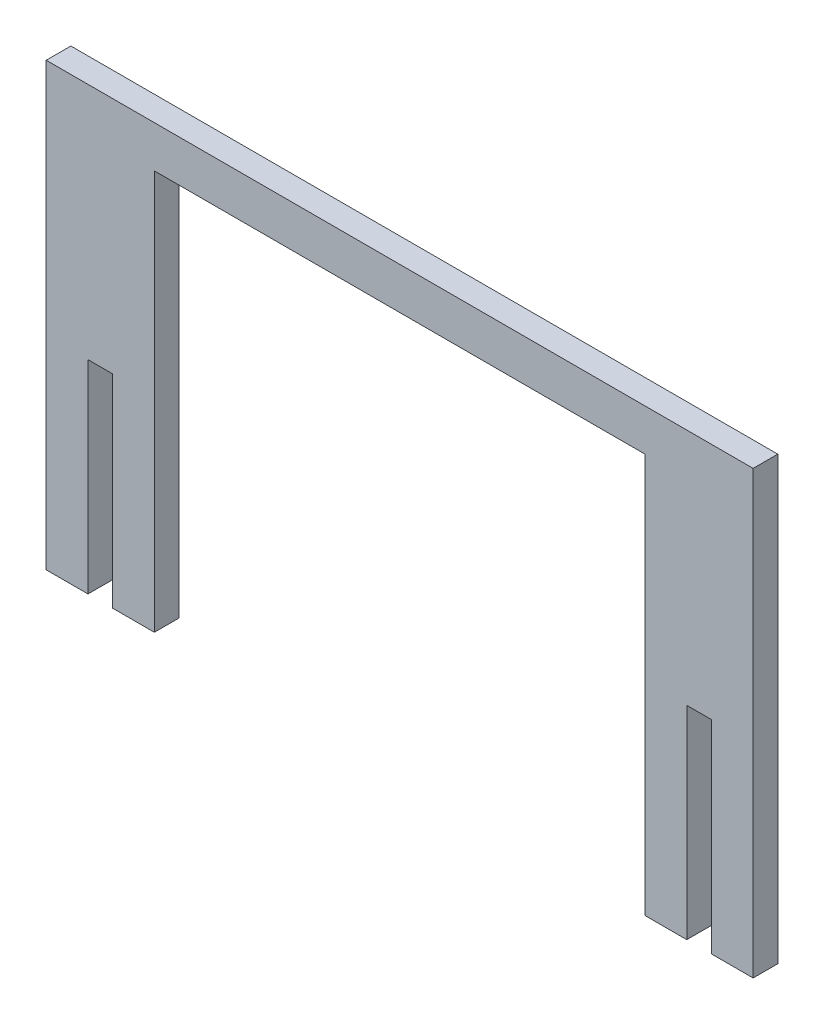
ISO-10303-21;
HEADER;
FILE_DESCRIPTION(('STEP AP214'),'2;1');
FILE_NAME('part.step','',(''),(''),'','','');
FILE_SCHEMA(('AUTOMOTIVE_DESIGN { 1 0 10303 214 1 1 1 1 }'));
ENDSEC;
DATA;
#1=APPLICATION_CONTEXT('core data for automotive mechanical design processes');
#2=APPLICATION_PROTOCOL_DEFINITION('international standard','automotive_design',2000,#1);
#3=PRODUCT_CONTEXT('',#1,'mechanical');
#4=PRODUCT('Part','Part','',(#3));
#5=PRODUCT_RELATED_PRODUCT_CATEGORY('part','',(#4));
#6=PRODUCT_DEFINITION_FORMATION('','',#4);
#7=PRODUCT_DEFINITION_CONTEXT('part definition',#1,'design');
#8=PRODUCT_DEFINITION('design','',#6,#7);
#9=PRODUCT_DEFINITION_SHAPE('','',#8);
#10=(LENGTH_UNIT() NAMED_UNIT(*) SI_UNIT(.MILLI.,.METRE.));
#11=(NAMED_UNIT(*) PLANE_ANGLE_UNIT() SI_UNIT($,.RADIAN.));
#12=(NAMED_UNIT(*) SI_UNIT($,.STERADIAN.) SOLID_ANGLE_UNIT());
#13=UNCERTAINTY_MEASURE_WITH_UNIT(LENGTH_MEASURE(1.E-05),#10,'distance_accuracy_value','');
#14=(GEOMETRIC_REPRESENTATION_CONTEXT(3) GLOBAL_UNCERTAINTY_ASSIGNED_CONTEXT((#13)) GLOBAL_UNIT_ASSIGNED_CONTEXT((#10,
#11,#12)) REPRESENTATION_CONTEXT('',''));
#15=CARTESIAN_POINT('',(0.,0.,0.));
#16=DIRECTION('',(0.,0.,1.));
#17=DIRECTION('',(1.,0.,0.));
#18=AXIS2_PLACEMENT_3D('',#15,#16,#17);
#19=CARTESIAN_POINT('',(0.,-0.762000000000471,2.9972));
#20=DIRECTION('',(-1.,0.,0.));
#21=DIRECTION('',(0.,0.,1.));
#22=AXIS2_PLACEMENT_3D('',#19,#20,#21);
#23=PLANE('',#22);
#24=DIRECTION('',(0.,1.,0.));
#25=VECTOR('',#24,1.);
#26=CARTESIAN_POINT('',(0.,-0.762000000000471,0.));
#27=LINE('',#26,#25);
#28=CARTESIAN_POINT('',(0.,-0.762000000000471,0.));
#29=VERTEX_POINT('',#28);
#30=CARTESIAN_POINT('',(0.,23.9268,0.));
#31=VERTEX_POINT('',#30);
#32=EDGE_CURVE('E177',#29,#31,#27,.T.);
#33=ORIENTED_EDGE('',*,*,#32,.T.);
#34=DIRECTION('',(0.,0.,-1.));
#35=VECTOR('',#34,1.);
#36=CARTESIAN_POINT('',(0.,23.9268,2.9972));
#37=LINE('',#36,#35);
#38=CARTESIAN_POINT('',(0.,23.9268,2.9972));
#39=VERTEX_POINT('',#38);
#40=EDGE_CURVE('E11',#39,#31,#37,.T.);
#41=ORIENTED_EDGE('',*,*,#40,.F.);
#42=DIRECTION('',(0.,1.,0.));
#43=VECTOR('',#42,1.);
#44=CARTESIAN_POINT('',(0.,-0.762000000000471,2.9972));
#45=LINE('',#44,#43);
#46=CARTESIAN_POINT('',(0.,-0.762000000000471,2.9972));
#47=VERTEX_POINT('',#46);
#48=EDGE_CURVE('E207',#47,#39,#45,.T.);
#49=ORIENTED_EDGE('',*,*,#48,.F.);
#50=DIRECTION('',(0.,0.,-1.));
#51=VECTOR('',#50,1.);
#52=CARTESIAN_POINT('',(0.,-0.762000000000471,2.9972));
#53=LINE('',#52,#51);
#54=EDGE_CURVE('E173',#47,#29,#53,.T.);
#55=ORIENTED_EDGE('',*,*,#54,.T.);
#56=EDGE_LOOP('',(#33,#41,#49,#55));
#57=FACE_BOUND('',#56,.T.);
#58=ADVANCED_FACE('F33',(#57),#23,.F.);
#59=CARTESIAN_POINT('',(0.,23.9268,2.9972));
#60=DIRECTION('',(0.,1.,0.));
#61=DIRECTION('',(0.,0.,1.));
#62=AXIS2_PLACEMENT_3D('',#59,#60,#61);
#63=PLANE('',#62);
#64=DIRECTION('',(1.,0.,0.));
#65=VECTOR('',#64,1.);
#66=CARTESIAN_POINT('',(0.,23.9268,0.));
#67=LINE('',#66,#65);
#68=CARTESIAN_POINT('',(2.9972,23.9268,0.));
#69=VERTEX_POINT('',#68);
#70=EDGE_CURVE('E180',#31,#69,#67,.T.);
#71=ORIENTED_EDGE('',*,*,#70,.T.);
#72=DIRECTION('',(0.,0.,-1.));
#73=VECTOR('',#72,1.);
#74=CARTESIAN_POINT('',(2.9972,23.9268,2.9972));
#75=LINE('',#74,#73);
#76=CARTESIAN_POINT('',(2.9972,23.9268,2.9972));
#77=VERTEX_POINT('',#76);
#78=EDGE_CURVE('E41',#77,#69,#75,.T.);
#79=ORIENTED_EDGE('',*,*,#78,.F.);
#80=DIRECTION('',(1.,0.,0.));
#81=VECTOR('',#80,1.);
#82=CARTESIAN_POINT('',(0.,23.9268,2.9972));
#83=LINE('',#82,#81);
#84=EDGE_CURVE('E116',#39,#77,#83,.T.);
#85=ORIENTED_EDGE('',*,*,#84,.F.);
#86=ORIENTED_EDGE('',*,*,#40,.T.);
#87=EDGE_LOOP('',(#71,#79,#85,#86));
#88=FACE_BOUND('',#87,.T.);
#89=ADVANCED_FACE('F305',(#88),#63,.F.);
#90=CARTESIAN_POINT('',(2.9972,23.9268,2.9972));
#91=DIRECTION('',(1.,0.,0.));
#92=DIRECTION('',(0.,1.,0.));
#93=AXIS2_PLACEMENT_3D('',#90,#91,#92);
#94=PLANE('',#93);
#95=DIRECTION('',(0.,-1.,0.));
#96=VECTOR('',#95,1.);
#97=CARTESIAN_POINT('',(2.9972,23.9268,0.));
#98=LINE('',#97,#96);
#99=CARTESIAN_POINT('',(2.9972,-0.762000000000472,0.));
#100=VERTEX_POINT('',#99);
#101=EDGE_CURVE('E182',#69,#100,#98,.T.);
#102=ORIENTED_EDGE('',*,*,#101,.T.);
#103=DIRECTION('',(0.,0.,-1.));
#104=VECTOR('',#103,1.);
#105=CARTESIAN_POINT('',(2.9972,-0.762000000000472,2.9972));
#106=LINE('',#105,#104);
#107=CARTESIAN_POINT('',(2.9972,-0.762000000000472,2.9972));
#108=VERTEX_POINT('',#107);
#109=EDGE_CURVE('E238',#108,#100,#106,.T.);
#110=ORIENTED_EDGE('',*,*,#109,.F.);
#111=DIRECTION('',(0.,-1.,0.));
#112=VECTOR('',#111,1.);
#113=CARTESIAN_POINT('',(2.9972,23.9268,2.9972));
#114=LINE('',#113,#112);
#115=EDGE_CURVE('E246',#77,#108,#114,.T.);
#116=ORIENTED_EDGE('',*,*,#115,.F.);
#117=ORIENTED_EDGE('',*,*,#78,.T.);
#118=EDGE_LOOP('',(#102,#110,#116,#117));
#119=FACE_BOUND('',#118,.T.);
#120=ADVANCED_FACE('F244',(#119),#94,.F.);
#121=CARTESIAN_POINT('',(2.9972,-0.762000000000472,2.9972));
#122=DIRECTION('',(0.,1.,0.));
#123=DIRECTION('',(0.,0.,1.));
#124=AXIS2_PLACEMENT_3D('',#121,#122,#123);
#125=PLANE('',#124);
#126=DIRECTION('',(1.,0.,0.));
#127=VECTOR('',#126,1.);
#128=CARTESIAN_POINT('',(2.9972,-0.762000000000472,0.));
#129=LINE('',#128,#127);
#130=CARTESIAN_POINT('',(8.07720000000001,-0.762000000000472,0.));
#131=VERTEX_POINT('',#130);
#132=EDGE_CURVE('E184',#100,#131,#129,.T.);
#133=ORIENTED_EDGE('',*,*,#132,.T.);
#134=DIRECTION('',(0.,0.,-1.));
#135=VECTOR('',#134,1.);
#136=CARTESIAN_POINT('',(8.07720000000001,-0.762000000000472,2.9972));
#137=LINE('',#136,#135);
#138=CARTESIAN_POINT('',(8.07720000000001,-0.762000000000472,2.9972));
#139=VERTEX_POINT('',#138);
#140=EDGE_CURVE('E235',#139,#131,#137,.T.);
#141=ORIENTED_EDGE('',*,*,#140,.F.);
#142=DIRECTION('',(1.,0.,0.));
#143=VECTOR('',#142,1.);
#144=CARTESIAN_POINT('',(2.9972,-0.762000000000472,2.9972));
#145=LINE('',#144,#143);
#146=EDGE_CURVE('E264',#108,#139,#145,.T.);
#147=ORIENTED_EDGE('',*,*,#146,.F.);
#148=ORIENTED_EDGE('',*,*,#109,.T.);
#149=EDGE_LOOP('',(#133,#141,#147,#148));
#150=FACE_BOUND('',#149,.T.);
#151=ADVANCED_FACE('F255',(#150),#125,.F.);
#152=CARTESIAN_POINT('',(8.07720000000001,-0.762000000000472,2.9972));
#153=DIRECTION('',(-1.,0.,0.));
#154=DIRECTION('',(0.,0.,1.));
#155=AXIS2_PLACEMENT_3D('',#152,#153,#154);
#156=PLANE('',#155);
#157=DIRECTION('',(0.,1.,0.));
#158=VECTOR('',#157,1.);
#159=CARTESIAN_POINT('',(8.07720000000001,-0.762000000000472,0.));
#160=LINE('',#159,#158);
#161=CARTESIAN_POINT('',(8.07720000000001,47.8536,0.));
#162=VERTEX_POINT('',#161);
#163=EDGE_CURVE('E186',#131,#162,#160,.T.);
#164=ORIENTED_EDGE('',*,*,#163,.T.);
#165=DIRECTION('',(0.,0.,-1.));
#166=VECTOR('',#165,1.);
#167=CARTESIAN_POINT('',(8.07720000000001,47.8536,2.9972));
#168=LINE('',#167,#166);
#169=CARTESIAN_POINT('',(8.07720000000001,47.8536,2.9972));
#170=VERTEX_POINT('',#169);
#171=EDGE_CURVE('E232',#170,#162,#168,.T.);
#172=ORIENTED_EDGE('',*,*,#171,.F.);
#173=DIRECTION('',(0.,1.,0.));
#174=VECTOR('',#173,1.);
#175=CARTESIAN_POINT('',(8.07720000000001,-0.762000000000472,2.9972));
#176=LINE('',#175,#174);
#177=EDGE_CURVE('E261',#139,#170,#176,.T.);
#178=ORIENTED_EDGE('',*,*,#177,.F.);
#179=ORIENTED_EDGE('',*,*,#140,.T.);
#180=EDGE_LOOP('',(#164,#172,#178,#179));
#181=FACE_BOUND('',#180,.T.);
#182=ADVANCED_FACE('F259',(#181),#156,.F.);
#183=CARTESIAN_POINT('',(8.07720000000001,47.8536,2.9972));
#184=DIRECTION('',(0.,1.,0.));
#185=DIRECTION('',(0.,0.,1.));
#186=AXIS2_PLACEMENT_3D('',#183,#184,#185);
#187=PLANE('',#186);
#188=DIRECTION('',(1.,0.,0.));
#189=VECTOR('',#188,1.);
#190=CARTESIAN_POINT('',(8.07720000000001,47.8536,0.));
#191=LINE('',#190,#189);
#192=CARTESIAN_POINT('',(67.7672,47.8536,0.));
#193=VERTEX_POINT('',#192);
#194=EDGE_CURVE('E188',#162,#193,#191,.T.);
#195=ORIENTED_EDGE('',*,*,#194,.T.);
#196=DIRECTION('',(0.,0.,-1.));
#197=VECTOR('',#196,1.);
#198=CARTESIAN_POINT('',(67.7672,47.8536,2.9972));
#199=LINE('',#198,#197);
#200=CARTESIAN_POINT('',(67.7672,47.8536,2.9972));
#201=VERTEX_POINT('',#200);
#202=EDGE_CURVE('E229',#201,#193,#199,.T.);
#203=ORIENTED_EDGE('',*,*,#202,.F.);
#204=DIRECTION('',(1.,0.,0.));
#205=VECTOR('',#204,1.);
#206=CARTESIAN_POINT('',(8.07720000000001,47.8536,2.9972));
#207=LINE('',#206,#205);
#208=EDGE_CURVE('E263',#170,#201,#207,.T.);
#209=ORIENTED_EDGE('',*,*,#208,.F.);
#210=ORIENTED_EDGE('',*,*,#171,.T.);
#211=EDGE_LOOP('',(#195,#203,#209,#210));
#212=FACE_BOUND('',#211,.T.);
#213=ADVANCED_FACE('F318',(#212),#187,.F.);
#214=CARTESIAN_POINT('',(67.7672,47.8536,2.9972));
#215=DIRECTION('',(1.,0.,0.));
#216=DIRECTION('',(0.,0.,-1.));
#217=AXIS2_PLACEMENT_3D('',#214,#215,#216);
#218=PLANE('',#217);
#219=DIRECTION('',(0.,-1.,0.));
#220=VECTOR('',#219,1.);
#221=CARTESIAN_POINT('',(67.7672,47.8536,0.));
#222=LINE('',#221,#220);
#223=CARTESIAN_POINT('',(67.7672,-0.762000000000471,0.));
#224=VERTEX_POINT('',#223);
#225=EDGE_CURVE('E190',#193,#224,#222,.T.);
#226=ORIENTED_EDGE('',*,*,#225,.T.);
#227=DIRECTION('',(0.,0.,-1.));
#228=VECTOR('',#227,1.);
#229=CARTESIAN_POINT('',(67.7672,-0.762000000000471,2.9972));
#230=LINE('',#229,#228);
#231=CARTESIAN_POINT('',(67.7672,-0.762000000000471,2.9972));
#232=VERTEX_POINT('',#231);
#233=EDGE_CURVE('E226',#232,#224,#230,.T.);
#234=ORIENTED_EDGE('',*,*,#233,.F.);
#235=DIRECTION('',(0.,-1.,0.));
#236=VECTOR('',#235,1.);
#237=CARTESIAN_POINT('',(67.7672,47.8536,2.9972));
#238=LINE('',#237,#236);
#239=EDGE_CURVE('E266',#201,#232,#238,.T.);
#240=ORIENTED_EDGE('',*,*,#239,.F.);
#241=ORIENTED_EDGE('',*,*,#202,.T.);
#242=EDGE_LOOP('',(#226,#234,#240,#241));
#243=FACE_BOUND('',#242,.T.);
#244=ADVANCED_FACE('F321',(#243),#218,.F.);
#245=CARTESIAN_POINT('',(67.7672,-0.762000000000471,2.9972));
#246=DIRECTION('',(0.,1.,0.));
#247=DIRECTION('',(-1.,0.,0.));
#248=AXIS2_PLACEMENT_3D('',#245,#246,#247);
#249=PLANE('',#248);
#250=DIRECTION('',(1.,0.,0.));
#251=VECTOR('',#250,1.);
#252=CARTESIAN_POINT('',(67.7672,-0.762000000000471,0.));
#253=LINE('',#252,#251);
#254=CARTESIAN_POINT('',(72.8472,-0.762000000000474,0.));
#255=VERTEX_POINT('',#254);
#256=EDGE_CURVE('E192',#224,#255,#253,.T.);
#257=ORIENTED_EDGE('',*,*,#256,.T.);
#258=DIRECTION('',(0.,0.,-1.));
#259=VECTOR('',#258,1.);
#260=CARTESIAN_POINT('',(72.8472,-0.762000000000474,2.9972));
#261=LINE('',#260,#259);
#262=CARTESIAN_POINT('',(72.8472,-0.762000000000474,2.9972));
#263=VERTEX_POINT('',#262);
#264=EDGE_CURVE('E223',#263,#255,#261,.T.);
#265=ORIENTED_EDGE('',*,*,#264,.F.);
#266=DIRECTION('',(1.,0.,0.));
#267=VECTOR('',#266,1.);
#268=CARTESIAN_POINT('',(67.7672,-0.762000000000471,2.9972));
#269=LINE('',#268,#267);
#270=EDGE_CURVE('E272',#232,#263,#269,.T.);
#271=ORIENTED_EDGE('',*,*,#270,.F.);
#272=ORIENTED_EDGE('',*,*,#233,.T.);
#273=EDGE_LOOP('',(#257,#265,#271,#272));
#274=FACE_BOUND('',#273,.T.);
#275=ADVANCED_FACE('F325',(#274),#249,.F.);
#276=CARTESIAN_POINT('',(72.8472,23.9268,2.9972));
#277=DIRECTION('',(-1.,0.,0.));
#278=DIRECTION('',(0.,0.,1.));
#279=AXIS2_PLACEMENT_3D('',#276,#277,#278);
#280=PLANE('',#279);
#281=DIRECTION('',(0.,1.,0.));
#282=VECTOR('',#281,1.);
#283=CARTESIAN_POINT('',(72.8472,23.9268,0.));
#284=LINE('',#283,#282);
#285=CARTESIAN_POINT('',(72.8472,23.9268,0.));
#286=VERTEX_POINT('',#285);
#287=EDGE_CURVE('E194',#255,#286,#284,.T.);
#288=ORIENTED_EDGE('',*,*,#287,.T.);
#289=DIRECTION('',(0.,0.,-1.));
#290=VECTOR('',#289,1.);
#291=CARTESIAN_POINT('',(72.8472,23.9268,2.9972));
#292=LINE('',#291,#290);
#293=CARTESIAN_POINT('',(72.8472,23.9268,2.9972));
#294=VERTEX_POINT('',#293);
#295=EDGE_CURVE('E220',#294,#286,#292,.T.);
#296=ORIENTED_EDGE('',*,*,#295,.F.);
#297=DIRECTION('',(0.,1.,0.));
#298=VECTOR('',#297,1.);
#299=CARTESIAN_POINT('',(72.8472,23.9268,2.9972));
#300=LINE('',#299,#298);
#301=EDGE_CURVE('E274',#263,#294,#300,.T.);
#302=ORIENTED_EDGE('',*,*,#301,.F.);
#303=ORIENTED_EDGE('',*,*,#264,.T.);
#304=EDGE_LOOP('',(#288,#296,#302,#303));
#305=FACE_BOUND('',#304,.T.);
#306=ADVANCED_FACE('F329',(#305),#280,.F.);
#307=CARTESIAN_POINT('',(75.8444,23.9268,2.9972));
#308=DIRECTION('',(0.,1.,0.));
#309=DIRECTION('',(0.,0.,1.));
#310=AXIS2_PLACEMENT_3D('',#307,#308,#309);
#311=PLANE('',#310);
#312=DIRECTION('',(1.,0.,0.));
#313=VECTOR('',#312,1.);
#314=CARTESIAN_POINT('',(75.8444,23.9268,0.));
#315=LINE('',#314,#313);
#316=CARTESIAN_POINT('',(75.8444,23.9268,0.));
#317=VERTEX_POINT('',#316);
#318=EDGE_CURVE('E196',#286,#317,#315,.T.);
#319=ORIENTED_EDGE('',*,*,#318,.T.);
#320=DIRECTION('',(0.,0.,-1.));
#321=VECTOR('',#320,1.);
#322=CARTESIAN_POINT('',(75.8444,23.9268,2.9972));
#323=LINE('',#322,#321);
#324=CARTESIAN_POINT('',(75.8444,23.9268,2.9972));
#325=VERTEX_POINT('',#324);
#326=EDGE_CURVE('E217',#325,#317,#323,.T.);
#327=ORIENTED_EDGE('',*,*,#326,.F.);
#328=DIRECTION('',(1.,0.,0.));
#329=VECTOR('',#328,1.);
#330=CARTESIAN_POINT('',(75.8444,23.9268,2.9972));
#331=LINE('',#330,#329);
#332=EDGE_CURVE('E276',#294,#325,#331,.T.);
#333=ORIENTED_EDGE('',*,*,#332,.F.);
#334=ORIENTED_EDGE('',*,*,#295,.T.);
#335=EDGE_LOOP('',(#319,#327,#333,#334));
#336=FACE_BOUND('',#335,.T.);
#337=ADVANCED_FACE('F333',(#336),#311,.F.);
#338=CARTESIAN_POINT('',(75.8444,-0.762000000000473,2.9972));
#339=DIRECTION('',(1.,0.,0.));
#340=DIRECTION('',(0.,0.,-1.));
#341=AXIS2_PLACEMENT_3D('',#338,#339,#340);
#342=PLANE('',#341);
#343=DIRECTION('',(0.,-1.,0.));
#344=VECTOR('',#343,1.);
#345=CARTESIAN_POINT('',(75.8444,-0.762000000000473,0.));
#346=LINE('',#345,#344);
#347=CARTESIAN_POINT('',(75.8444,-0.762000000000473,0.));
#348=VERTEX_POINT('',#347);
#349=EDGE_CURVE('E198',#317,#348,#346,.T.);
#350=ORIENTED_EDGE('',*,*,#349,.T.);
#351=DIRECTION('',(0.,0.,-1.));
#352=VECTOR('',#351,1.);
#353=CARTESIAN_POINT('',(75.8444,-0.762000000000473,2.9972));
#354=LINE('',#353,#352);
#355=CARTESIAN_POINT('',(75.8444,-0.762000000000473,2.9972));
#356=VERTEX_POINT('',#355);
#357=EDGE_CURVE('E214',#356,#348,#354,.T.);
#358=ORIENTED_EDGE('',*,*,#357,.F.);
#359=DIRECTION('',(0.,-1.,0.));
#360=VECTOR('',#359,1.);
#361=CARTESIAN_POINT('',(75.8444,-0.762000000000473,2.9972));
#362=LINE('',#361,#360);
#363=EDGE_CURVE('E278',#325,#356,#362,.T.);
#364=ORIENTED_EDGE('',*,*,#363,.F.);
#365=ORIENTED_EDGE('',*,*,#326,.T.);
#366=EDGE_LOOP('',(#350,#358,#364,#365));
#367=FACE_BOUND('',#366,.T.);
#368=ADVANCED_FACE('F337',(#367),#342,.F.);
#369=CARTESIAN_POINT('',(80.9244,-0.762000000000472,2.9972));
#370=DIRECTION('',(0.,1.,0.));
#371=DIRECTION('',(-1.,0.,0.));
#372=AXIS2_PLACEMENT_3D('',#369,#370,#371);
#373=PLANE('',#372);
#374=DIRECTION('',(1.,0.,0.));
#375=VECTOR('',#374,1.);
#376=CARTESIAN_POINT('',(80.9244,-0.762000000000472,0.));
#377=LINE('',#376,#375);
#378=CARTESIAN_POINT('',(80.9244,-0.762000000000472,0.));
#379=VERTEX_POINT('',#378);
#380=EDGE_CURVE('E200',#348,#379,#377,.T.);
#381=ORIENTED_EDGE('',*,*,#380,.T.);
#382=DIRECTION('',(0.,0.,-1.));
#383=VECTOR('',#382,1.);
#384=CARTESIAN_POINT('',(80.9244,-0.762000000000472,2.9972));
#385=LINE('',#384,#383);
#386=CARTESIAN_POINT('',(80.9244,-0.762000000000472,2.9972));
#387=VERTEX_POINT('',#386);
#388=EDGE_CURVE('E211',#387,#379,#385,.T.);
#389=ORIENTED_EDGE('',*,*,#388,.F.);
#390=DIRECTION('',(1.,0.,0.));
#391=VECTOR('',#390,1.);
#392=CARTESIAN_POINT('',(80.9244,-0.762000000000472,2.9972));
#393=LINE('',#392,#391);
#394=EDGE_CURVE('E280',#356,#387,#393,.T.);
#395=ORIENTED_EDGE('',*,*,#394,.F.);
#396=ORIENTED_EDGE('',*,*,#357,.T.);
#397=EDGE_LOOP('',(#381,#389,#395,#396));
#398=FACE_BOUND('',#397,.T.);
#399=ADVANCED_FACE('F286',(#398),#373,.F.);
#400=CARTESIAN_POINT('',(80.9244,52.9336,2.9972));
#401=DIRECTION('',(-1.,0.,0.));
#402=DIRECTION('',(0.,0.,1.));
#403=AXIS2_PLACEMENT_3D('',#400,#401,#402);
#404=PLANE('',#403);
#405=DIRECTION('',(0.,1.,0.));
#406=VECTOR('',#405,1.);
#407=CARTESIAN_POINT('',(80.9244,52.9336,0.));
#408=LINE('',#407,#406);
#409=CARTESIAN_POINT('',(80.9244,52.9336,0.));
#410=VERTEX_POINT('',#409);
#411=EDGE_CURVE('E202',#379,#410,#408,.T.);
#412=ORIENTED_EDGE('',*,*,#411,.T.);
#413=DIRECTION('',(0.,0.,-1.));
#414=VECTOR('',#413,1.);
#415=CARTESIAN_POINT('',(80.9244,52.9336,2.9972));
#416=LINE('',#415,#414);
#417=CARTESIAN_POINT('',(80.9244,52.9336,2.9972));
#418=VERTEX_POINT('',#417);
#419=EDGE_CURVE('E168',#418,#410,#416,.T.);
#420=ORIENTED_EDGE('',*,*,#419,.F.);
#421=DIRECTION('',(0.,1.,0.));
#422=VECTOR('',#421,1.);
#423=CARTESIAN_POINT('',(80.9244,52.9336,2.9972));
#424=LINE('',#423,#422);
#425=EDGE_CURVE('E159',#387,#418,#424,.T.);
#426=ORIENTED_EDGE('',*,*,#425,.F.);
#427=ORIENTED_EDGE('',*,*,#388,.T.);
#428=EDGE_LOOP('',(#412,#420,#426,#427));
#429=FACE_BOUND('',#428,.T.);
#430=ADVANCED_FACE('F290',(#429),#404,.F.);
#431=CARTESIAN_POINT('',(80.9244,52.9336,2.9972));
#432=DIRECTION('',(0.,-1.,0.));
#433=DIRECTION('',(1.,0.,0.));
#434=AXIS2_PLACEMENT_3D('',#431,#432,#433);
#435=PLANE('',#434);
#436=DIRECTION('',(-1.,0.,0.));
#437=VECTOR('',#436,1.);
#438=CARTESIAN_POINT('',(80.9244,52.9336,0.));
#439=LINE('',#438,#437);
#440=CARTESIAN_POINT('',(-5.08000000000001,52.9336,0.));
#441=VERTEX_POINT('',#440);
#442=EDGE_CURVE('E167',#410,#441,#439,.T.);
#443=ORIENTED_EDGE('',*,*,#442,.T.);
#444=DIRECTION('',(0.,0.,-1.));
#445=VECTOR('',#444,1.);
#446=CARTESIAN_POINT('',(-5.08000000000001,52.9336,2.9972));
#447=LINE('',#446,#445);
#448=CARTESIAN_POINT('',(-5.08000000000001,52.9336,2.9972));
#449=VERTEX_POINT('',#448);
#450=EDGE_CURVE('E164',#449,#441,#447,.T.);
#451=ORIENTED_EDGE('',*,*,#450,.F.);
#452=DIRECTION('',(-1.,0.,0.));
#453=VECTOR('',#452,1.);
#454=CARTESIAN_POINT('',(80.9244,52.9336,2.9972));
#455=LINE('',#454,#453);
#456=EDGE_CURVE('E153',#418,#449,#455,.T.);
#457=ORIENTED_EDGE('',*,*,#456,.F.);
#458=ORIENTED_EDGE('',*,*,#419,.T.);
#459=EDGE_LOOP('',(#443,#451,#457,#458));
#460=FACE_BOUND('',#459,.T.);
#461=ADVANCED_FACE('F165',(#460),#435,.F.);
#462=CARTESIAN_POINT('',(-5.08000000000001,52.9336,2.9972));
#463=DIRECTION('',(1.,0.,0.));
#464=DIRECTION('',(0.,1.,0.));
#465=AXIS2_PLACEMENT_3D('',#462,#463,#464);
#466=PLANE('',#465);
#467=DIRECTION('',(0.,-1.,0.));
#468=VECTOR('',#467,1.);
#469=CARTESIAN_POINT('',(-5.08000000000001,52.9336,0.));
#470=LINE('',#469,#468);
#471=CARTESIAN_POINT('',(-5.08,-0.762000000000472,0.));
#472=VERTEX_POINT('',#471);
#473=EDGE_CURVE('E102',#441,#472,#470,.T.);
#474=ORIENTED_EDGE('',*,*,#473,.T.);
#475=DIRECTION('',(0.,0.,-1.));
#476=VECTOR('',#475,1.);
#477=CARTESIAN_POINT('',(-5.08,-0.762000000000472,2.9972));
#478=LINE('',#477,#476);
#479=CARTESIAN_POINT('',(-5.08,-0.762000000000472,2.9972));
#480=VERTEX_POINT('',#479);
#481=EDGE_CURVE('E169',#480,#472,#478,.T.);
#482=ORIENTED_EDGE('',*,*,#481,.F.);
#483=DIRECTION('',(0.,-1.,0.));
#484=VECTOR('',#483,1.);
#485=CARTESIAN_POINT('',(-5.08000000000001,52.9336,2.9972));
#486=LINE('',#485,#484);
#487=EDGE_CURVE('E157',#449,#480,#486,.T.);
#488=ORIENTED_EDGE('',*,*,#487,.F.);
#489=ORIENTED_EDGE('',*,*,#450,.T.);
#490=EDGE_LOOP('',(#474,#482,#488,#489));
#491=FACE_BOUND('',#490,.T.);
#492=ADVANCED_FACE('F171',(#491),#466,.F.);
#493=CARTESIAN_POINT('',(-5.08,-0.762000000000472,2.9972));
#494=DIRECTION('',(0.,1.,0.));
#495=DIRECTION('',(-1.,0.,0.));
#496=AXIS2_PLACEMENT_3D('',#493,#494,#495);
#497=PLANE('',#496);
#498=DIRECTION('',(1.,0.,0.));
#499=VECTOR('',#498,1.);
#500=CARTESIAN_POINT('',(-5.08,-0.762000000000472,0.));
#501=LINE('',#500,#499);
#502=EDGE_CURVE('E108',#472,#29,#501,.T.);
#503=ORIENTED_EDGE('',*,*,#502,.T.);
#504=ORIENTED_EDGE('',*,*,#54,.F.);
#505=DIRECTION('',(1.,0.,0.));
#506=VECTOR('',#505,1.);
#507=CARTESIAN_POINT('',(-5.08,-0.762000000000472,2.9972));
#508=LINE('',#507,#506);
#509=EDGE_CURVE('E49',#480,#47,#508,.T.);
#510=ORIENTED_EDGE('',*,*,#509,.F.);
#511=ORIENTED_EDGE('',*,*,#481,.T.);
#512=EDGE_LOOP('',(#503,#504,#510,#511));
#513=FACE_BOUND('',#512,.T.);
#514=ADVANCED_FACE('F294',(#513),#497,.F.);
#515=CARTESIAN_POINT('',(0.,0.,2.9972));
#516=DIRECTION('',(0.,0.,-1.));
#517=DIRECTION('',(-1.,0.,0.));
#518=AXIS2_PLACEMENT_3D('',#515,#516,#517);
#519=PLANE('',#518);
#520=ORIENTED_EDGE('',*,*,#48,.T.);
#521=ORIENTED_EDGE('',*,*,#84,.T.);
#522=ORIENTED_EDGE('',*,*,#115,.T.);
#523=ORIENTED_EDGE('',*,*,#146,.T.);
#524=ORIENTED_EDGE('',*,*,#177,.T.);
#525=ORIENTED_EDGE('',*,*,#208,.T.);
#526=ORIENTED_EDGE('',*,*,#239,.T.);
#527=ORIENTED_EDGE('',*,*,#270,.T.);
#528=ORIENTED_EDGE('',*,*,#301,.T.);
#529=ORIENTED_EDGE('',*,*,#332,.T.);
#530=ORIENTED_EDGE('',*,*,#363,.T.);
#531=ORIENTED_EDGE('',*,*,#394,.T.);
#532=ORIENTED_EDGE('',*,*,#425,.T.);
#533=ORIENTED_EDGE('',*,*,#456,.T.);
#534=ORIENTED_EDGE('',*,*,#487,.T.);
#535=ORIENTED_EDGE('',*,*,#509,.T.);
#536=EDGE_LOOP('',(#520,#521,#522,#523,#524,#525,#526,#527,#528,#529,#530,#531,#532,#533,#534,#535));
#537=FACE_BOUND('',#536,.T.);
#538=ADVANCED_FACE('F155',(#537),#519,.F.);
#539=CARTESIAN_POINT('',(0.,0.,0.));
#540=DIRECTION('',(0.,0.,-1.));
#541=DIRECTION('',(-1.,0.,0.));
#542=AXIS2_PLACEMENT_3D('',#539,#540,#541);
#543=PLANE('',#542);
#544=ORIENTED_EDGE('',*,*,#32,.F.);
#545=ORIENTED_EDGE('',*,*,#502,.F.);
#546=ORIENTED_EDGE('',*,*,#473,.F.);
#547=ORIENTED_EDGE('',*,*,#442,.F.);
#548=ORIENTED_EDGE('',*,*,#411,.F.);
#549=ORIENTED_EDGE('',*,*,#380,.F.);
#550=ORIENTED_EDGE('',*,*,#349,.F.);
#551=ORIENTED_EDGE('',*,*,#318,.F.);
#552=ORIENTED_EDGE('',*,*,#287,.F.);
#553=ORIENTED_EDGE('',*,*,#256,.F.);
#554=ORIENTED_EDGE('',*,*,#225,.F.);
#555=ORIENTED_EDGE('',*,*,#194,.F.);
#556=ORIENTED_EDGE('',*,*,#163,.F.);
#557=ORIENTED_EDGE('',*,*,#132,.F.);
#558=ORIENTED_EDGE('',*,*,#101,.F.);
#559=ORIENTED_EDGE('',*,*,#70,.F.);
#560=EDGE_LOOP('',(#544,#545,#546,#547,#548,#549,#550,#551,#552,#553,#554,#555,#556,#557,#558,#559));
#561=FACE_BOUND('',#560,.T.);
#562=ADVANCED_FACE('F250',(#561),#543,.T.);
#563=CLOSED_SHELL('',(#58,#89,#120,#151,#182,#213,#244,#275,#306,#337,#368,#399,#430,#461,#492,
#514,#538,#562));
#564=MANIFOLD_SOLID_BREP('B2',#563);
#565=ADVANCED_BREP_SHAPE_REPRESENTATION('',(#18,#564),#14);
#566=SHAPE_DEFINITION_REPRESENTATION(#9,#565);
ENDSEC;
END-ISO-10303-21;
